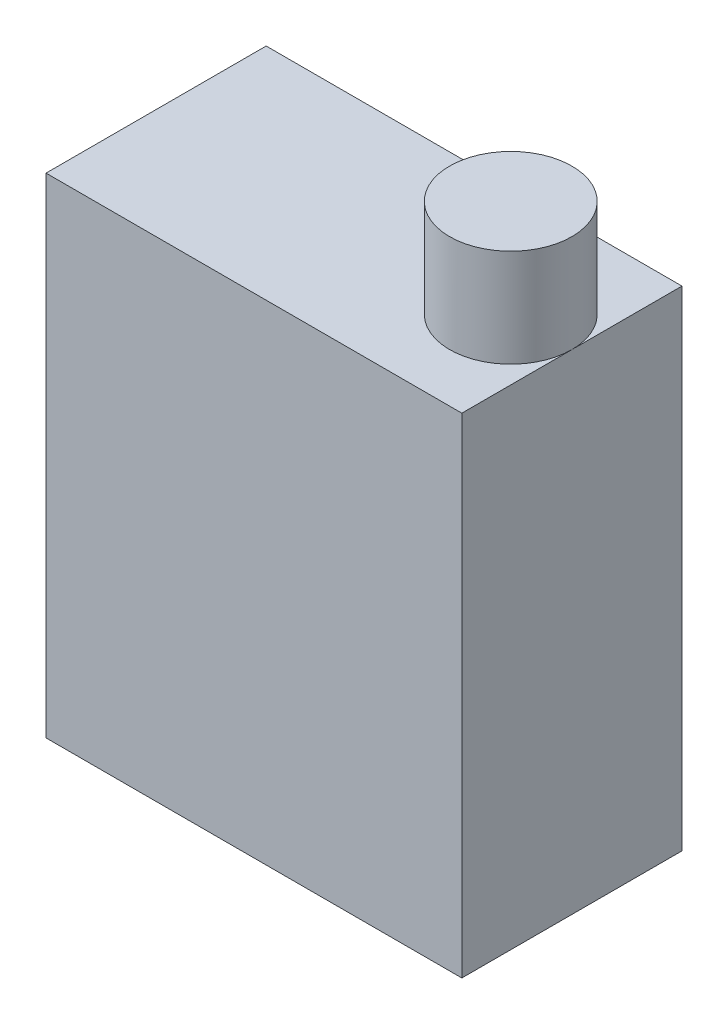
ISO-10303-21;
HEADER;
FILE_DESCRIPTION(('STEP AP214'),'2;1');
FILE_NAME('part.step','',(''),(''),'','','');
FILE_SCHEMA(('AUTOMOTIVE_DESIGN { 1 0 10303 214 1 1 1 1 }'));
ENDSEC;
DATA;
#1=APPLICATION_CONTEXT('core data for automotive mechanical design processes');
#2=APPLICATION_PROTOCOL_DEFINITION('international standard','automotive_design',2000,#1);
#3=PRODUCT_CONTEXT('',#1,'mechanical');
#4=PRODUCT('Part','Part','',(#3));
#5=PRODUCT_RELATED_PRODUCT_CATEGORY('part','',(#4));
#6=PRODUCT_DEFINITION_FORMATION('','',#4);
#7=PRODUCT_DEFINITION_CONTEXT('part definition',#1,'design');
#8=PRODUCT_DEFINITION('design','',#6,#7);
#9=PRODUCT_DEFINITION_SHAPE('','',#8);
#10=(LENGTH_UNIT() NAMED_UNIT(*) SI_UNIT(.MILLI.,.METRE.));
#11=(NAMED_UNIT(*) PLANE_ANGLE_UNIT() SI_UNIT($,.RADIAN.));
#12=(NAMED_UNIT(*) SI_UNIT($,.STERADIAN.) SOLID_ANGLE_UNIT());
#13=UNCERTAINTY_MEASURE_WITH_UNIT(LENGTH_MEASURE(1.E-05),#10,'distance_accuracy_value','');
#14=(GEOMETRIC_REPRESENTATION_CONTEXT(3) GLOBAL_UNCERTAINTY_ASSIGNED_CONTEXT((#13)) GLOBAL_UNIT_ASSIGNED_CONTEXT((#10,
#11,#12)) REPRESENTATION_CONTEXT('',''));
#15=CARTESIAN_POINT('',(0.,0.,0.));
#16=DIRECTION('',(0.,0.,1.));
#17=DIRECTION('',(1.,0.,0.));
#18=AXIS2_PLACEMENT_3D('',#15,#16,#17);
#19=CARTESIAN_POINT('',(-4.9784,5.08,-0.863599999999999));
#20=DIRECTION('',(1.,0.,0.));
#21=DIRECTION('',(0.,0.,-1.));
#22=AXIS2_PLACEMENT_3D('',#19,#20,#21);
#23=PLANE('',#22);
#24=DIRECTION('',(0.,0.,1.));
#25=VECTOR('',#24,1.);
#26=CARTESIAN_POINT('',(-4.9784,0.,-0.863599999999999));
#27=LINE('',#26,#25);
#28=CARTESIAN_POINT('',(-4.9784,0.,-0.863599999999999));
#29=VERTEX_POINT('',#28);
#30=CARTESIAN_POINT('',(-4.9784,0.,1.4224));
#31=VERTEX_POINT('',#30);
#32=EDGE_CURVE('E111',#29,#31,#27,.T.);
#33=ORIENTED_EDGE('',*,*,#32,.T.);
#34=DIRECTION('',(0.,-1.,0.));
#35=VECTOR('',#34,1.);
#36=CARTESIAN_POINT('',(-4.9784,5.08,1.4224));
#37=LINE('',#36,#35);
#38=CARTESIAN_POINT('',(-4.9784,5.08,1.4224));
#39=VERTEX_POINT('',#38);
#40=EDGE_CURVE('E11',#39,#31,#37,.T.);
#41=ORIENTED_EDGE('',*,*,#40,.F.);
#42=DIRECTION('',(0.,0.,1.));
#43=VECTOR('',#42,1.);
#44=CARTESIAN_POINT('',(-4.9784,5.08,-0.863599999999999));
#45=LINE('',#44,#43);
#46=CARTESIAN_POINT('',(-4.9784,5.08,-0.863599999999999));
#47=VERTEX_POINT('',#46);
#48=EDGE_CURVE('E104',#47,#39,#45,.T.);
#49=ORIENTED_EDGE('',*,*,#48,.F.);
#50=DIRECTION('',(0.,-1.,0.));
#51=VECTOR('',#50,1.);
#52=CARTESIAN_POINT('',(-4.9784,5.08,-0.863599999999999));
#53=LINE('',#52,#51);
#54=EDGE_CURVE('E110',#47,#29,#53,.T.);
#55=ORIENTED_EDGE('',*,*,#54,.T.);
#56=EDGE_LOOP('',(#33,#41,#49,#55));
#57=FACE_BOUND('',#56,.T.);
#58=ADVANCED_FACE('F39',(#57),#23,.F.);
#59=CARTESIAN_POINT('',(-4.9784,5.08,1.4224));
#60=DIRECTION('',(0.,0.,-1.));
#61=DIRECTION('',(-1.,0.,0.));
#62=AXIS2_PLACEMENT_3D('',#59,#60,#61);
#63=PLANE('',#62);
#64=DIRECTION('',(1.,0.,0.));
#65=VECTOR('',#64,1.);
#66=CARTESIAN_POINT('',(-4.9784,0.,1.4224));
#67=LINE('',#66,#65);
#68=CARTESIAN_POINT('',(-0.660399999999996,0.,1.4224));
#69=VERTEX_POINT('',#68);
#70=EDGE_CURVE('E115',#31,#69,#67,.T.);
#71=ORIENTED_EDGE('',*,*,#70,.T.);
#72=DIRECTION('',(0.,-1.,0.));
#73=VECTOR('',#72,1.);
#74=CARTESIAN_POINT('',(-0.660399999999996,5.08,1.4224));
#75=LINE('',#74,#73);
#76=CARTESIAN_POINT('',(-0.660399999999996,5.08,1.4224));
#77=VERTEX_POINT('',#76);
#78=EDGE_CURVE('E48',#77,#69,#75,.T.);
#79=ORIENTED_EDGE('',*,*,#78,.F.);
#80=DIRECTION('',(1.,0.,0.));
#81=VECTOR('',#80,1.);
#82=CARTESIAN_POINT('',(-4.9784,5.08,1.4224));
#83=LINE('',#82,#81);
#84=EDGE_CURVE('E87',#39,#77,#83,.T.);
#85=ORIENTED_EDGE('',*,*,#84,.F.);
#86=ORIENTED_EDGE('',*,*,#40,.T.);
#87=EDGE_LOOP('',(#71,#79,#85,#86));
#88=FACE_BOUND('',#87,.T.);
#89=ADVANCED_FACE('F141',(#88),#63,.F.);
#90=CARTESIAN_POINT('',(-0.660399999999997,5.08,-0.863599999999999));
#91=DIRECTION('',(-1.,0.,0.));
#92=DIRECTION('',(0.,0.,1.));
#93=AXIS2_PLACEMENT_3D('',#90,#91,#92);
#94=PLANE('',#93);
#95=DIRECTION('',(0.,0.,-1.));
#96=VECTOR('',#95,1.);
#97=CARTESIAN_POINT('',(-0.660399999999997,0.,-0.863599999999999));
#98=LINE('',#97,#96);
#99=CARTESIAN_POINT('',(-0.660399999999997,0.,-0.863599999999999));
#100=VERTEX_POINT('',#99);
#101=EDGE_CURVE('E74',#69,#100,#98,.T.);
#102=ORIENTED_EDGE('',*,*,#101,.T.);
#103=DIRECTION('',(0.,-1.,0.));
#104=VECTOR('',#103,1.);
#105=CARTESIAN_POINT('',(-0.660399999999997,5.08,-0.863599999999999));
#106=LINE('',#105,#104);
#107=CARTESIAN_POINT('',(-0.660399999999997,5.08,-0.863599999999999));
#108=VERTEX_POINT('',#107);
#109=EDGE_CURVE('E101',#108,#100,#106,.T.);
#110=ORIENTED_EDGE('',*,*,#109,.F.);
#111=DIRECTION('',(0.,0.,-1.));
#112=VECTOR('',#111,1.);
#113=CARTESIAN_POINT('',(-0.660399999999997,5.08,-0.863599999999999));
#114=LINE('',#113,#112);
#115=CARTESIAN_POINT('',(-0.660399999999996,5.08,0.279400000000001));
#116=VERTEX_POINT('',#115);
#117=EDGE_CURVE('E98',#116,#108,#114,.T.);
#118=ORIENTED_EDGE('',*,*,#117,.F.);
#119=EDGE_CURVE('E92',#77,#116,#114,.T.);
#120=ORIENTED_EDGE('',*,*,#119,.F.);
#121=ORIENTED_EDGE('',*,*,#78,.T.);
#122=EDGE_LOOP('',(#102,#110,#118,#120,#121));
#123=FACE_BOUND('',#122,.T.);
#124=ADVANCED_FACE('F100',(#123),#94,.F.);
#125=CARTESIAN_POINT('',(-4.9784,5.08,-0.863599999999999));
#126=DIRECTION('',(0.,0.,1.));
#127=DIRECTION('',(1.,0.,0.));
#128=AXIS2_PLACEMENT_3D('',#125,#126,#127);
#129=PLANE('',#128);
#130=DIRECTION('',(-1.,0.,0.));
#131=VECTOR('',#130,1.);
#132=CARTESIAN_POINT('',(-4.9784,0.,-0.863599999999999));
#133=LINE('',#132,#131);
#134=EDGE_CURVE('E80',#100,#29,#133,.T.);
#135=ORIENTED_EDGE('',*,*,#134,.T.);
#136=ORIENTED_EDGE('',*,*,#54,.F.);
#137=DIRECTION('',(-1.,0.,0.));
#138=VECTOR('',#137,1.);
#139=CARTESIAN_POINT('',(-4.9784,5.08,-0.863599999999999));
#140=LINE('',#139,#138);
#141=EDGE_CURVE('E56',#108,#47,#140,.T.);
#142=ORIENTED_EDGE('',*,*,#141,.F.);
#143=ORIENTED_EDGE('',*,*,#109,.T.);
#144=EDGE_LOOP('',(#135,#136,#142,#143));
#145=FACE_BOUND('',#144,.T.);
#146=ADVANCED_FACE('F133',(#145),#129,.F.);
#147=CARTESIAN_POINT('',(0.,5.08,0.));
#148=DIRECTION('',(0.,1.,0.));
#149=DIRECTION('',(0.,0.,1.));
#150=AXIS2_PLACEMENT_3D('',#147,#148,#149);
#151=PLANE('',#150);
#152=ORIENTED_EDGE('',*,*,#119,.T.);
#153=CARTESIAN_POINT('',(-1.2954,5.08,0.279400000000001));
#154=DIRECTION('',(0.,1.,0.));
#155=DIRECTION('',(0.,0.,1.));
#156=AXIS2_PLACEMENT_3D('',#153,#154,#155);
#157=CIRCLE('',#156,0.635);
#158=EDGE_CURVE('E96',#116,#116,#157,.T.);
#159=ORIENTED_EDGE('',*,*,#158,.F.);
#160=ORIENTED_EDGE('',*,*,#117,.T.);
#161=ORIENTED_EDGE('',*,*,#141,.T.);
#162=ORIENTED_EDGE('',*,*,#48,.T.);
#163=ORIENTED_EDGE('',*,*,#84,.T.);
#164=EDGE_LOOP('',(#152,#159,#160,#161,#162,#163));
#165=FACE_BOUND('',#164,.T.);
#166=ADVANCED_FACE('F94',(#165),#151,.T.);
#167=CARTESIAN_POINT('',(0.,0.,0.));
#168=DIRECTION('',(0.,1.,0.));
#169=DIRECTION('',(0.,0.,1.));
#170=AXIS2_PLACEMENT_3D('',#167,#168,#169);
#171=PLANE('',#170);
#172=ORIENTED_EDGE('',*,*,#32,.F.);
#173=ORIENTED_EDGE('',*,*,#134,.F.);
#174=ORIENTED_EDGE('',*,*,#101,.F.);
#175=ORIENTED_EDGE('',*,*,#70,.F.);
#176=EDGE_LOOP('',(#172,#173,#174,#175));
#177=FACE_BOUND('',#176,.T.);
#178=ADVANCED_FACE('F129',(#177),#171,.F.);
#179=CARTESIAN_POINT('',(-1.2954,6.096,0.279400000000001));
#180=DIRECTION('',(0.,-1.,0.));
#181=DIRECTION('',(0.,0.,-1.));
#182=AXIS2_PLACEMENT_3D('',#179,#180,#181);
#183=CYLINDRICAL_SURFACE('',#182,0.635);
#184=CARTESIAN_POINT('',(-1.2954,6.096,0.279400000000001));
#185=DIRECTION('',(0.,1.,0.));
#186=DIRECTION('',(0.,0.,1.));
#187=AXIS2_PLACEMENT_3D('',#184,#185,#186);
#188=CIRCLE('',#187,0.635);
#189=CARTESIAN_POINT('',(-1.2954,6.096,0.914400000000002));
#190=VERTEX_POINT('',#189);
#191=EDGE_CURVE('E116',#190,#190,#188,.T.);
#192=ORIENTED_EDGE('',*,*,#191,.F.);
#193=EDGE_LOOP('',(#192));
#194=FACE_BOUND('',#193,.T.);
#195=ORIENTED_EDGE('',*,*,#158,.T.);
#196=EDGE_LOOP('',(#195));
#197=FACE_BOUND('',#196,.T.);
#198=ADVANCED_FACE('F170',(#194,#197),#183,.T.);
#199=CARTESIAN_POINT('',(-1.2954,6.096,0.279400000000001));
#200=DIRECTION('',(0.,1.,0.));
#201=DIRECTION('',(0.,0.,1.));
#202=AXIS2_PLACEMENT_3D('',#199,#200,#201);
#203=PLANE('',#202);
#204=ORIENTED_EDGE('',*,*,#191,.T.);
#205=EDGE_LOOP('',(#204));
#206=FACE_BOUND('',#205,.T.);
#207=ADVANCED_FACE('F175',(#206),#203,.T.);
#208=CLOSED_SHELL('',(#58,#89,#124,#146,#166,#178,#198,#207));
#209=MANIFOLD_SOLID_BREP('B2',#208);
#210=ADVANCED_BREP_SHAPE_REPRESENTATION('',(#18,#209),#14);
#211=SHAPE_DEFINITION_REPRESENTATION(#9,#210);
ENDSEC;
END-ISO-10303-21;
